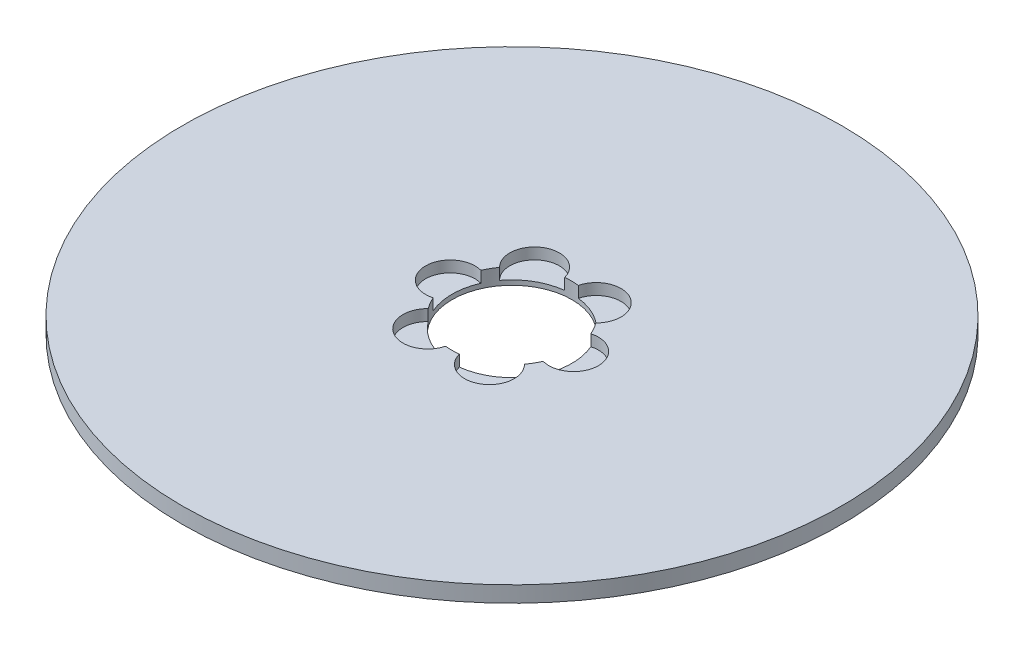
ISO-10303-21;
HEADER;
FILE_DESCRIPTION(('STEP AP214'),'2;1');
FILE_NAME('part.step','',(''),(''),'','','');
FILE_SCHEMA(('AUTOMOTIVE_DESIGN { 1 0 10303 214 1 1 1 1 }'));
ENDSEC;
DATA;
#1=APPLICATION_CONTEXT('core data for automotive mechanical design processes');
#2=APPLICATION_PROTOCOL_DEFINITION('international standard','automotive_design',2000,#1);
#3=PRODUCT_CONTEXT('',#1,'mechanical');
#4=PRODUCT('Part','Part','',(#3));
#5=PRODUCT_RELATED_PRODUCT_CATEGORY('part','',(#4));
#6=PRODUCT_DEFINITION_FORMATION('','',#4);
#7=PRODUCT_DEFINITION_CONTEXT('part definition',#1,'design');
#8=PRODUCT_DEFINITION('design','',#6,#7);
#9=PRODUCT_DEFINITION_SHAPE('','',#8);
#10=(LENGTH_UNIT() NAMED_UNIT(*) SI_UNIT(.MILLI.,.METRE.));
#11=(NAMED_UNIT(*) PLANE_ANGLE_UNIT() SI_UNIT($,.RADIAN.));
#12=(NAMED_UNIT(*) SI_UNIT($,.STERADIAN.) SOLID_ANGLE_UNIT());
#13=UNCERTAINTY_MEASURE_WITH_UNIT(LENGTH_MEASURE(1.E-05),#10,'distance_accuracy_value','');
#14=(GEOMETRIC_REPRESENTATION_CONTEXT(3) GLOBAL_UNCERTAINTY_ASSIGNED_CONTEXT((#13)) GLOBAL_UNIT_ASSIGNED_CONTEXT((#10,
#11,#12)) REPRESENTATION_CONTEXT('',''));
#15=CARTESIAN_POINT('',(0.,0.,0.));
#16=DIRECTION('',(0.,0.,1.));
#17=DIRECTION('',(1.,0.,0.));
#18=AXIS2_PLACEMENT_3D('',#15,#16,#17);
#19=CARTESIAN_POINT('',(0.,4.,0.));
#20=DIRECTION('',(0.,-1.,0.));
#21=DIRECTION('',(0.,0.,-1.));
#22=AXIS2_PLACEMENT_3D('',#19,#20,#21);
#23=CYLINDRICAL_SURFACE('',#22,82.5);
#24=CARTESIAN_POINT('',(0.,4.,0.));
#25=DIRECTION('',(0.,1.,0.));
#26=DIRECTION('',(0.,0.,1.));
#27=AXIS2_PLACEMENT_3D('',#24,#25,#26);
#28=CIRCLE('',#27,82.5);
#29=CARTESIAN_POINT('',(0.,4.,82.5));
#30=VERTEX_POINT('',#29);
#31=EDGE_CURVE('E171',#30,#30,#28,.T.);
#32=ORIENTED_EDGE('',*,*,#31,.F.);
#33=EDGE_LOOP('',(#32));
#34=FACE_BOUND('',#33,.T.);
#35=CARTESIAN_POINT('',(0.,0.,0.));
#36=DIRECTION('',(0.,1.,0.));
#37=DIRECTION('',(0.,0.,1.));
#38=AXIS2_PLACEMENT_3D('',#35,#36,#37);
#39=CIRCLE('',#38,82.5);
#40=CARTESIAN_POINT('',(0.,0.,82.5));
#41=VERTEX_POINT('',#40);
#42=EDGE_CURVE('E157',#41,#41,#39,.T.);
#43=ORIENTED_EDGE('',*,*,#42,.T.);
#44=EDGE_LOOP('',(#43));
#45=FACE_BOUND('',#44,.T.);
#46=ADVANCED_FACE('F39',(#34,#45),#23,.T.);
#47=CARTESIAN_POINT('',(0.,4.,0.));
#48=DIRECTION('',(0.,1.,0.));
#49=DIRECTION('',(0.,0.,1.));
#50=AXIS2_PLACEMENT_3D('',#47,#48,#49);
#51=PLANE('',#50);
#52=CARTESIAN_POINT('',(-7.72099198494681,4.,-13.3731504027596));
#53=DIRECTION('',(0.,1.,0.));
#54=DIRECTION('',(-0.866025403784433,0.,0.50000000000001));
#55=AXIS2_PLACEMENT_3D('',#52,#53,#54);
#56=CIRCLE('',#55,6.19689080013102);
#57=CARTESIAN_POINT('',(-1.71554632287376,4.,-14.9015737697088));
#58=VERTEX_POINT('',#57);
#59=CARTESIAN_POINT('',(-12.047368279499,4.,-8.93649358183179));
#60=VERTEX_POINT('',#59);
#61=EDGE_CURVE('E214',#58,#60,#56,.T.);
#62=ORIENTED_EDGE('',*,*,#61,.F.);
#63=CARTESIAN_POINT('',(0.,4.,0.));
#64=DIRECTION('',(0.,1.,0.));
#65=DIRECTION('',(0.,0.,1.));
#66=AXIS2_PLACEMENT_3D('',#63,#64,#65);
#67=CIRCLE('',#66,15.);
#68=CARTESIAN_POINT('',(1.71554632287345,4.,-14.9015737697089));
#69=VERTEX_POINT('',#68);
#70=EDGE_CURVE('E272',#69,#58,#67,.T.);
#71=ORIENTED_EDGE('',*,*,#70,.F.);
#72=CARTESIAN_POINT('',(7.72099198494653,4.,-13.3731504027597));
#73=DIRECTION('',(0.,1.,0.));
#74=DIRECTION('',(-0.866025403784443,0.,-0.499999999999992));
#75=AXIS2_PLACEMENT_3D('',#72,#73,#74);
#76=CIRCLE('',#75,6.19689080013102);
#77=CARTESIAN_POINT('',(12.0473682794988,4.,-8.93649358183205));
#78=VERTEX_POINT('',#77);
#79=EDGE_CURVE('E285',#78,#69,#76,.T.);
#80=ORIENTED_EDGE('',*,*,#79,.F.);
#81=CARTESIAN_POINT('',(13.7629146023725,4.,-5.96508018787692));
#82=VERTEX_POINT('',#81);
#83=EDGE_CURVE('E165',#82,#78,#67,.T.);
#84=ORIENTED_EDGE('',*,*,#83,.F.);
#85=CARTESIAN_POINT('',(15.4419839698933,4.,0.));
#86=DIRECTION('',(0.,1.,0.));
#87=DIRECTION('',(0.,0.,-1.));
#88=AXIS2_PLACEMENT_3D('',#85,#86,#87);
#89=CIRCLE('',#88,6.19689080013102);
#90=CARTESIAN_POINT('',(13.7629146023725,4.,5.96508018787692));
#91=VERTEX_POINT('',#90);
#92=EDGE_CURVE('E281',#91,#82,#89,.T.);
#93=ORIENTED_EDGE('',*,*,#92,.F.);
#94=CARTESIAN_POINT('',(12.047368279499,4.,8.93649358183188));
#95=VERTEX_POINT('',#94);
#96=EDGE_CURVE('E160',#95,#91,#67,.T.);
#97=ORIENTED_EDGE('',*,*,#96,.F.);
#98=CARTESIAN_POINT('',(7.72099198494672,4.,13.3731504027596));
#99=DIRECTION('',(0.,1.,0.));
#100=DIRECTION('',(0.866025403784436,0.,-0.500000000000004));
#101=AXIS2_PLACEMENT_3D('',#98,#99,#100);
#102=CIRCLE('',#101,6.19689080013102);
#103=CARTESIAN_POINT('',(1.71554632287366,4.,14.9015737697088));
#104=VERTEX_POINT('',#103);
#105=EDGE_CURVE('E154',#104,#95,#102,.T.);
#106=ORIENTED_EDGE('',*,*,#105,.F.);
#107=CARTESIAN_POINT('',(-1.71554632287355,4.,14.9015737697089));
#108=VERTEX_POINT('',#107);
#109=EDGE_CURVE('E150',#108,#104,#67,.T.);
#110=ORIENTED_EDGE('',*,*,#109,.F.);
#111=CARTESIAN_POINT('',(-7.72099198494662,4.,13.3731504027597));
#112=DIRECTION('',(0.,1.,0.));
#113=DIRECTION('',(0.86602540378444,0.,0.499999999999998));
#114=AXIS2_PLACEMENT_3D('',#111,#112,#113);
#115=CIRCLE('',#114,6.19689080013102);
#116=CARTESIAN_POINT('',(-12.0473682794989,4.,8.93649358183196));
#117=VERTEX_POINT('',#116);
#118=EDGE_CURVE('E127',#117,#108,#115,.T.);
#119=ORIENTED_EDGE('',*,*,#118,.F.);
#120=CARTESIAN_POINT('',(-13.7629146023725,4.,5.96508018787692));
#121=VERTEX_POINT('',#120);
#122=EDGE_CURVE('E156',#121,#117,#67,.T.);
#123=ORIENTED_EDGE('',*,*,#122,.F.);
#124=CARTESIAN_POINT('',(-15.4419839698933,4.,0.));
#125=DIRECTION('',(0.,1.,0.));
#126=DIRECTION('',(0.,0.,1.));
#127=AXIS2_PLACEMENT_3D('',#124,#125,#126);
#128=CIRCLE('',#127,6.19689080013102);
#129=CARTESIAN_POINT('',(-13.7629146023725,4.,-5.96508018787692));
#130=VERTEX_POINT('',#129);
#131=EDGE_CURVE('E164',#130,#121,#128,.T.);
#132=ORIENTED_EDGE('',*,*,#131,.F.);
#133=EDGE_CURVE('E159',#60,#130,#67,.T.);
#134=ORIENTED_EDGE('',*,*,#133,.F.);
#135=EDGE_LOOP('',(#62,#71,#80,#84,#93,#97,#106,#110,#119,#123,#132,#134));
#136=FACE_BOUND('',#135,.T.);
#137=ORIENTED_EDGE('',*,*,#31,.T.);
#138=EDGE_LOOP('',(#137));
#139=FACE_BOUND('',#138,.T.);
#140=ADVANCED_FACE('F155',(#136,#139),#51,.T.);
#141=CARTESIAN_POINT('',(0.,0.,0.));
#142=DIRECTION('',(0.,1.,0.));
#143=DIRECTION('',(0.,0.,1.));
#144=AXIS2_PLACEMENT_3D('',#141,#142,#143);
#145=PLANE('',#144);
#146=CARTESIAN_POINT('',(0.,0.,0.));
#147=DIRECTION('',(0.,1.,0.));
#148=DIRECTION('',(0.,0.,1.));
#149=AXIS2_PLACEMENT_3D('',#146,#147,#148);
#150=CIRCLE('',#149,15.);
#151=CARTESIAN_POINT('',(0.,0.,15.));
#152=VERTEX_POINT('',#151);
#153=EDGE_CURVE('E170',#152,#152,#150,.T.);
#154=ORIENTED_EDGE('',*,*,#153,.T.);
#155=EDGE_LOOP('',(#154));
#156=FACE_BOUND('',#155,.T.);
#157=ORIENTED_EDGE('',*,*,#42,.F.);
#158=EDGE_LOOP('',(#157));
#159=FACE_BOUND('',#158,.T.);
#160=ADVANCED_FACE('F232',(#156,#159),#145,.F.);
#161=CARTESIAN_POINT('',(0.,4.,0.));
#162=DIRECTION('',(0.,-1.,0.));
#163=DIRECTION('',(0.,0.,-1.));
#164=AXIS2_PLACEMENT_3D('',#161,#162,#163);
#165=CYLINDRICAL_SURFACE('',#164,15.);
#166=DIRECTION('',(0.,1.,0.));
#167=VECTOR('',#166,1.);
#168=CARTESIAN_POINT('',(-1.71554632287376,2.59403225664073,-14.9015737697088));
#169=LINE('',#168,#167);
#170=CARTESIAN_POINT('',(-1.71554632287376,1.18806451328146,-14.9015737697088));
#171=VERTEX_POINT('',#170);
#172=EDGE_CURVE('E11',#171,#58,#169,.T.);
#173=ORIENTED_EDGE('',*,*,#172,.F.);
#174=CARTESIAN_POINT('',(0.,1.18806451328146,0.));
#175=DIRECTION('',(0.,1.,0.));
#176=DIRECTION('',(0.,0.,1.));
#177=AXIS2_PLACEMENT_3D('',#174,#175,#176);
#178=CIRCLE('',#177,15.);
#179=CARTESIAN_POINT('',(-12.047368279499,1.18806451328146,-8.93649358183179));
#180=VERTEX_POINT('',#179);
#181=EDGE_CURVE('E209',#171,#180,#178,.T.);
#182=ORIENTED_EDGE('',*,*,#181,.T.);
#183=DIRECTION('',(0.,1.,0.));
#184=VECTOR('',#183,1.);
#185=CARTESIAN_POINT('',(-12.047368279499,2.59403225664073,-8.93649358183179));
#186=LINE('',#185,#184);
#187=EDGE_CURVE('E46',#60,#180,#186,.F.);
#188=ORIENTED_EDGE('',*,*,#187,.F.);
#189=ORIENTED_EDGE('',*,*,#133,.T.);
#190=DIRECTION('',(0.,1.,0.));
#191=VECTOR('',#190,1.);
#192=CARTESIAN_POINT('',(-13.7629146023725,2.59403225664073,-5.96508018787692));
#193=LINE('',#192,#191);
#194=CARTESIAN_POINT('',(-13.7629146023725,1.18806451328146,-5.96508018787692));
#195=VERTEX_POINT('',#194);
#196=EDGE_CURVE('E185',#195,#130,#193,.T.);
#197=ORIENTED_EDGE('',*,*,#196,.F.);
#198=CARTESIAN_POINT('',(0.,1.18806451328146,0.));
#199=DIRECTION('',(0.,1.,0.));
#200=DIRECTION('',(0.,0.,1.));
#201=AXIS2_PLACEMENT_3D('',#198,#199,#200);
#202=CIRCLE('',#201,15.);
#203=CARTESIAN_POINT('',(-13.7629146023725,1.18806451328146,5.96508018787692));
#204=VERTEX_POINT('',#203);
#205=EDGE_CURVE('E173',#195,#204,#202,.T.);
#206=ORIENTED_EDGE('',*,*,#205,.T.);
#207=DIRECTION('',(0.,1.,0.));
#208=VECTOR('',#207,1.);
#209=CARTESIAN_POINT('',(-13.7629146023725,2.59403225664073,5.96508018787692));
#210=LINE('',#209,#208);
#211=EDGE_CURVE('E178',#121,#204,#210,.F.);
#212=ORIENTED_EDGE('',*,*,#211,.F.);
#213=ORIENTED_EDGE('',*,*,#122,.T.);
#214=DIRECTION('',(0.,1.,0.));
#215=VECTOR('',#214,1.);
#216=CARTESIAN_POINT('',(-12.0473682794989,2.59403225664073,8.93649358183196));
#217=LINE('',#216,#215);
#218=CARTESIAN_POINT('',(-12.0473682794989,1.18806451328146,8.93649358183196));
#219=VERTEX_POINT('',#218);
#220=EDGE_CURVE('E132',#219,#117,#217,.T.);
#221=ORIENTED_EDGE('',*,*,#220,.F.);
#222=CARTESIAN_POINT('',(0.,1.18806451328146,0.));
#223=DIRECTION('',(0.,1.,0.));
#224=DIRECTION('',(0.,0.,1.));
#225=AXIS2_PLACEMENT_3D('',#222,#223,#224);
#226=CIRCLE('',#225,15.);
#227=CARTESIAN_POINT('',(-1.71554632287355,1.18806451328146,14.9015737697089));
#228=VERTEX_POINT('',#227);
#229=EDGE_CURVE('E146',#219,#228,#226,.T.);
#230=ORIENTED_EDGE('',*,*,#229,.T.);
#231=DIRECTION('',(0.,1.,0.));
#232=VECTOR('',#231,1.);
#233=CARTESIAN_POINT('',(-1.71554632287355,2.59403225664073,14.9015737697089));
#234=LINE('',#233,#232);
#235=EDGE_CURVE('E128',#108,#228,#234,.F.);
#236=ORIENTED_EDGE('',*,*,#235,.F.);
#237=ORIENTED_EDGE('',*,*,#109,.T.);
#238=DIRECTION('',(0.,1.,0.));
#239=VECTOR('',#238,1.);
#240=CARTESIAN_POINT('',(1.71554632287366,2.59403225664073,14.9015737697088));
#241=LINE('',#240,#239);
#242=CARTESIAN_POINT('',(1.71554632287366,1.18806451328146,14.9015737697088));
#243=VERTEX_POINT('',#242);
#244=EDGE_CURVE('E192',#243,#104,#241,.T.);
#245=ORIENTED_EDGE('',*,*,#244,.F.);
#246=CARTESIAN_POINT('',(0.,1.18806451328146,0.));
#247=DIRECTION('',(0.,1.,0.));
#248=DIRECTION('',(0.,0.,1.));
#249=AXIS2_PLACEMENT_3D('',#246,#247,#248);
#250=CIRCLE('',#249,15.);
#251=CARTESIAN_POINT('',(12.047368279499,1.18806451328146,8.93649358183188));
#252=VERTEX_POINT('',#251);
#253=EDGE_CURVE('E190',#243,#252,#250,.T.);
#254=ORIENTED_EDGE('',*,*,#253,.T.);
#255=DIRECTION('',(0.,1.,0.));
#256=VECTOR('',#255,1.);
#257=CARTESIAN_POINT('',(12.047368279499,2.59403225664073,8.93649358183188));
#258=LINE('',#257,#256);
#259=EDGE_CURVE('E189',#95,#252,#258,.F.);
#260=ORIENTED_EDGE('',*,*,#259,.F.);
#261=ORIENTED_EDGE('',*,*,#96,.T.);
#262=DIRECTION('',(0.,1.,0.));
#263=VECTOR('',#262,1.);
#264=CARTESIAN_POINT('',(13.7629146023725,2.59403225664073,5.96508018787692));
#265=LINE('',#264,#263);
#266=CARTESIAN_POINT('',(13.7629146023725,1.18806451328146,5.96508018787692));
#267=VERTEX_POINT('',#266);
#268=EDGE_CURVE('E203',#267,#91,#265,.T.);
#269=ORIENTED_EDGE('',*,*,#268,.F.);
#270=CARTESIAN_POINT('',(0.,1.18806451328146,0.));
#271=DIRECTION('',(0.,1.,0.));
#272=DIRECTION('',(0.,0.,1.));
#273=AXIS2_PLACEMENT_3D('',#270,#271,#272);
#274=CIRCLE('',#273,15.);
#275=CARTESIAN_POINT('',(13.7629146023725,1.18806451328146,-5.96508018787692));
#276=VERTEX_POINT('',#275);
#277=EDGE_CURVE('E194',#267,#276,#274,.T.);
#278=ORIENTED_EDGE('',*,*,#277,.T.);
#279=DIRECTION('',(0.,1.,0.));
#280=VECTOR('',#279,1.);
#281=CARTESIAN_POINT('',(13.7629146023725,2.59403225664073,-5.96508018787692));
#282=LINE('',#281,#280);
#283=EDGE_CURVE('E196',#82,#276,#282,.F.);
#284=ORIENTED_EDGE('',*,*,#283,.F.);
#285=ORIENTED_EDGE('',*,*,#83,.T.);
#286=DIRECTION('',(0.,1.,0.));
#287=VECTOR('',#286,1.);
#288=CARTESIAN_POINT('',(12.0473682794988,2.59403225664073,-8.93649358183205));
#289=LINE('',#288,#287);
#290=CARTESIAN_POINT('',(12.0473682794988,1.18806451328146,-8.93649358183205));
#291=VERTEX_POINT('',#290);
#292=EDGE_CURVE('E208',#291,#78,#289,.T.);
#293=ORIENTED_EDGE('',*,*,#292,.F.);
#294=CARTESIAN_POINT('',(0.,1.18806451328146,0.));
#295=DIRECTION('',(0.,1.,0.));
#296=DIRECTION('',(0.,0.,1.));
#297=AXIS2_PLACEMENT_3D('',#294,#295,#296);
#298=CIRCLE('',#297,15.);
#299=CARTESIAN_POINT('',(1.71554632287345,1.18806451328146,-14.9015737697089));
#300=VERTEX_POINT('',#299);
#301=EDGE_CURVE('E201',#291,#300,#298,.T.);
#302=ORIENTED_EDGE('',*,*,#301,.T.);
#303=DIRECTION('',(0.,1.,0.));
#304=VECTOR('',#303,1.);
#305=CARTESIAN_POINT('',(1.71554632287345,2.59403225664073,-14.9015737697089));
#306=LINE('',#305,#304);
#307=EDGE_CURVE('E206',#69,#300,#306,.F.);
#308=ORIENTED_EDGE('',*,*,#307,.F.);
#309=ORIENTED_EDGE('',*,*,#70,.T.);
#310=EDGE_LOOP('',(#173,#182,#188,#189,#197,#206,#212,#213,#221,#230,#236,#237,#245,#254,#260,
#261,#269,#278,#284,#285,#293,#302,#308,#309));
#311=FACE_BOUND('',#310,.T.);
#312=ORIENTED_EDGE('',*,*,#153,.F.);
#313=EDGE_LOOP('',(#312));
#314=FACE_BOUND('',#313,.T.);
#315=ADVANCED_FACE('F145',(#311,#314),#165,.F.);
#316=CARTESIAN_POINT('',(-15.4419839698933,1.18806451328146,0.));
#317=DIRECTION('',(0.,1.,0.));
#318=DIRECTION('',(0.,0.,1.));
#319=AXIS2_PLACEMENT_3D('',#316,#317,#318);
#320=CYLINDRICAL_SURFACE('',#319,6.19689080013102);
#321=ORIENTED_EDGE('',*,*,#196,.T.);
#322=ORIENTED_EDGE('',*,*,#131,.T.);
#323=ORIENTED_EDGE('',*,*,#211,.T.);
#324=CARTESIAN_POINT('',(-15.4419839698933,1.18806451328146,0.));
#325=DIRECTION('',(0.,1.,0.));
#326=DIRECTION('',(0.,0.,1.));
#327=AXIS2_PLACEMENT_3D('',#324,#325,#326);
#328=CIRCLE('',#327,6.19689080013102);
#329=EDGE_CURVE('E168',#195,#204,#328,.T.);
#330=ORIENTED_EDGE('',*,*,#329,.F.);
#331=EDGE_LOOP('',(#321,#322,#323,#330));
#332=FACE_BOUND('',#331,.T.);
#333=ADVANCED_FACE('F243',(#332),#320,.F.);
#334=CARTESIAN_POINT('',(-15.4419839698933,1.18806451328146,0.));
#335=DIRECTION('',(0.,1.,0.));
#336=DIRECTION('',(0.,0.,1.));
#337=AXIS2_PLACEMENT_3D('',#334,#335,#336);
#338=PLANE('',#337);
#339=ORIENTED_EDGE('',*,*,#329,.T.);
#340=ORIENTED_EDGE('',*,*,#205,.F.);
#341=EDGE_LOOP('',(#339,#340));
#342=FACE_BOUND('',#341,.T.);
#343=ADVANCED_FACE('F247',(#342),#338,.T.);
#344=CARTESIAN_POINT('',(-7.72099198494662,1.18806451328146,13.3731504027597));
#345=DIRECTION('',(0.,1.,0.));
#346=DIRECTION('',(0.,0.,1.));
#347=AXIS2_PLACEMENT_3D('',#344,#345,#346);
#348=CYLINDRICAL_SURFACE('',#347,6.19689080013102);
#349=ORIENTED_EDGE('',*,*,#220,.T.);
#350=ORIENTED_EDGE('',*,*,#118,.T.);
#351=ORIENTED_EDGE('',*,*,#235,.T.);
#352=CARTESIAN_POINT('',(-7.72099198494662,1.18806451328146,13.3731504027597));
#353=DIRECTION('',(0.,1.,0.));
#354=DIRECTION('',(0.86602540378444,0.,0.499999999999998));
#355=AXIS2_PLACEMENT_3D('',#352,#353,#354);
#356=CIRCLE('',#355,6.19689080013102);
#357=EDGE_CURVE('E137',#219,#228,#356,.T.);
#358=ORIENTED_EDGE('',*,*,#357,.F.);
#359=EDGE_LOOP('',(#349,#350,#351,#358));
#360=FACE_BOUND('',#359,.T.);
#361=ADVANCED_FACE('F126',(#360),#348,.F.);
#362=CARTESIAN_POINT('',(-7.72099198494662,1.18806451328146,13.3731504027597));
#363=DIRECTION('',(0.,1.,0.));
#364=DIRECTION('',(0.86602540378444,0.,0.499999999999998));
#365=AXIS2_PLACEMENT_3D('',#362,#363,#364);
#366=PLANE('',#365);
#367=ORIENTED_EDGE('',*,*,#357,.T.);
#368=ORIENTED_EDGE('',*,*,#229,.F.);
#369=EDGE_LOOP('',(#367,#368));
#370=FACE_BOUND('',#369,.T.);
#371=ADVANCED_FACE('F254',(#370),#366,.T.);
#372=CARTESIAN_POINT('',(7.72099198494672,1.18806451328146,13.3731504027596));
#373=DIRECTION('',(0.,1.,0.));
#374=DIRECTION('',(0.,0.,1.));
#375=AXIS2_PLACEMENT_3D('',#372,#373,#374);
#376=CYLINDRICAL_SURFACE('',#375,6.19689080013102);
#377=ORIENTED_EDGE('',*,*,#244,.T.);
#378=ORIENTED_EDGE('',*,*,#105,.T.);
#379=ORIENTED_EDGE('',*,*,#259,.T.);
#380=CARTESIAN_POINT('',(7.72099198494672,1.18806451328146,13.3731504027596));
#381=DIRECTION('',(0.,1.,0.));
#382=DIRECTION('',(0.866025403784436,0.,-0.500000000000004));
#383=AXIS2_PLACEMENT_3D('',#380,#381,#382);
#384=CIRCLE('',#383,6.19689080013102);
#385=EDGE_CURVE('E138',#243,#252,#384,.T.);
#386=ORIENTED_EDGE('',*,*,#385,.F.);
#387=EDGE_LOOP('',(#377,#378,#379,#386));
#388=FACE_BOUND('',#387,.T.);
#389=ADVANCED_FACE('F260',(#388),#376,.F.);
#390=CARTESIAN_POINT('',(7.72099198494672,1.18806451328146,13.3731504027596));
#391=DIRECTION('',(0.,1.,0.));
#392=DIRECTION('',(0.866025403784436,0.,-0.500000000000004));
#393=AXIS2_PLACEMENT_3D('',#390,#391,#392);
#394=PLANE('',#393);
#395=ORIENTED_EDGE('',*,*,#385,.T.);
#396=ORIENTED_EDGE('',*,*,#253,.F.);
#397=EDGE_LOOP('',(#395,#396));
#398=FACE_BOUND('',#397,.T.);
#399=ADVANCED_FACE('F265',(#398),#394,.T.);
#400=CARTESIAN_POINT('',(15.4419839698933,1.18806451328146,0.));
#401=DIRECTION('',(0.,1.,0.));
#402=DIRECTION('',(0.,0.,1.));
#403=AXIS2_PLACEMENT_3D('',#400,#401,#402);
#404=CYLINDRICAL_SURFACE('',#403,6.19689080013102);
#405=ORIENTED_EDGE('',*,*,#268,.T.);
#406=ORIENTED_EDGE('',*,*,#92,.T.);
#407=ORIENTED_EDGE('',*,*,#283,.T.);
#408=CARTESIAN_POINT('',(15.4419839698933,1.18806451328146,0.));
#409=DIRECTION('',(0.,1.,0.));
#410=DIRECTION('',(0.,0.,-1.));
#411=AXIS2_PLACEMENT_3D('',#408,#409,#410);
#412=CIRCLE('',#411,6.19689080013102);
#413=EDGE_CURVE('E287',#267,#276,#412,.T.);
#414=ORIENTED_EDGE('',*,*,#413,.F.);
#415=EDGE_LOOP('',(#405,#406,#407,#414));
#416=FACE_BOUND('',#415,.T.);
#417=ADVANCED_FACE('F300',(#416),#404,.F.);
#418=CARTESIAN_POINT('',(15.4419839698933,1.18806451328146,0.));
#419=DIRECTION('',(0.,1.,0.));
#420=DIRECTION('',(0.,0.,-1.));
#421=AXIS2_PLACEMENT_3D('',#418,#419,#420);
#422=PLANE('',#421);
#423=ORIENTED_EDGE('',*,*,#413,.T.);
#424=ORIENTED_EDGE('',*,*,#277,.F.);
#425=EDGE_LOOP('',(#423,#424));
#426=FACE_BOUND('',#425,.T.);
#427=ADVANCED_FACE('F298',(#426),#422,.T.);
#428=CARTESIAN_POINT('',(7.72099198494653,1.18806451328146,-13.3731504027597));
#429=DIRECTION('',(0.,1.,0.));
#430=DIRECTION('',(0.,0.,1.));
#431=AXIS2_PLACEMENT_3D('',#428,#429,#430);
#432=CYLINDRICAL_SURFACE('',#431,6.19689080013102);
#433=ORIENTED_EDGE('',*,*,#292,.T.);
#434=ORIENTED_EDGE('',*,*,#79,.T.);
#435=ORIENTED_EDGE('',*,*,#307,.T.);
#436=CARTESIAN_POINT('',(7.72099198494653,1.18806451328146,-13.3731504027597));
#437=DIRECTION('',(0.,1.,0.));
#438=DIRECTION('',(-0.866025403784443,0.,-0.499999999999992));
#439=AXIS2_PLACEMENT_3D('',#436,#437,#438);
#440=CIRCLE('',#439,6.19689080013102);
#441=EDGE_CURVE('E56',#291,#300,#440,.T.);
#442=ORIENTED_EDGE('',*,*,#441,.F.);
#443=EDGE_LOOP('',(#433,#434,#435,#442));
#444=FACE_BOUND('',#443,.T.);
#445=ADVANCED_FACE('F301',(#444),#432,.F.);
#446=CARTESIAN_POINT('',(7.72099198494653,1.18806451328146,-13.3731504027597));
#447=DIRECTION('',(0.,1.,0.));
#448=DIRECTION('',(-0.866025403784443,0.,-0.499999999999992));
#449=AXIS2_PLACEMENT_3D('',#446,#447,#448);
#450=PLANE('',#449);
#451=ORIENTED_EDGE('',*,*,#441,.T.);
#452=ORIENTED_EDGE('',*,*,#301,.F.);
#453=EDGE_LOOP('',(#451,#452));
#454=FACE_BOUND('',#453,.T.);
#455=ADVANCED_FACE('F221',(#454),#450,.T.);
#456=CARTESIAN_POINT('',(-7.72099198494681,1.18806451328146,-13.3731504027596));
#457=DIRECTION('',(0.,1.,0.));
#458=DIRECTION('',(0.,0.,1.));
#459=AXIS2_PLACEMENT_3D('',#456,#457,#458);
#460=CYLINDRICAL_SURFACE('',#459,6.19689080013102);
#461=ORIENTED_EDGE('',*,*,#172,.T.);
#462=ORIENTED_EDGE('',*,*,#61,.T.);
#463=ORIENTED_EDGE('',*,*,#187,.T.);
#464=CARTESIAN_POINT('',(-7.72099198494681,1.18806451328146,-13.3731504027596));
#465=DIRECTION('',(0.,1.,0.));
#466=DIRECTION('',(-0.866025403784433,0.,0.50000000000001));
#467=AXIS2_PLACEMENT_3D('',#464,#465,#466);
#468=CIRCLE('',#467,6.19689080013102);
#469=EDGE_CURVE('E55',#171,#180,#468,.T.);
#470=ORIENTED_EDGE('',*,*,#469,.F.);
#471=EDGE_LOOP('',(#461,#462,#463,#470));
#472=FACE_BOUND('',#471,.T.);
#473=ADVANCED_FACE('F212',(#472),#460,.F.);
#474=CARTESIAN_POINT('',(-7.72099198494681,1.18806451328146,-13.3731504027596));
#475=DIRECTION('',(0.,1.,0.));
#476=DIRECTION('',(-0.866025403784433,0.,0.50000000000001));
#477=AXIS2_PLACEMENT_3D('',#474,#475,#476);
#478=PLANE('',#477);
#479=ORIENTED_EDGE('',*,*,#469,.T.);
#480=ORIENTED_EDGE('',*,*,#181,.F.);
#481=EDGE_LOOP('',(#479,#480));
#482=FACE_BOUND('',#481,.T.);
#483=ADVANCED_FACE('F217',(#482),#478,.T.);
#484=CLOSED_SHELL('',(#46,#140,#160,#315,#333,#343,#361,#371,#389,#399,#417,#427,#445,#455,#473,#483));
#485=MANIFOLD_SOLID_BREP('B2',#484);
#486=ADVANCED_BREP_SHAPE_REPRESENTATION('',(#18,#485),#14);
#487=SHAPE_DEFINITION_REPRESENTATION(#9,#486);
ENDSEC;
END-ISO-10303-21;
